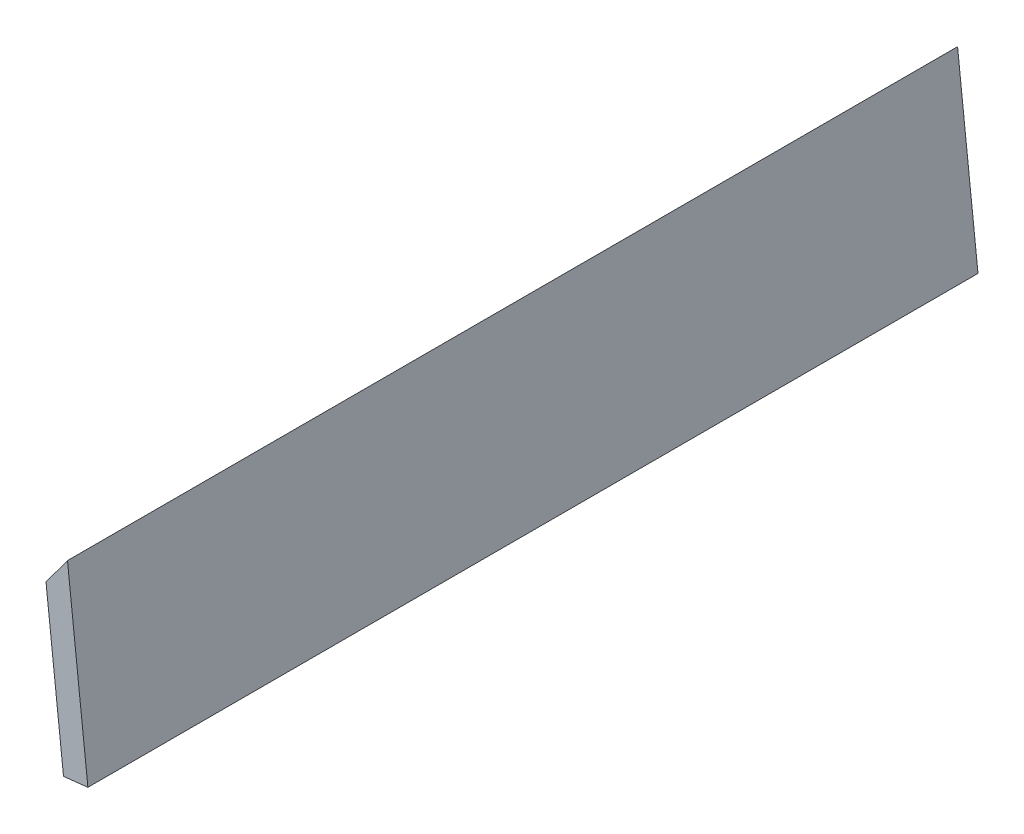
ISO-10303-21;
HEADER;
FILE_DESCRIPTION(('STEP AP214'),'2;1');
FILE_NAME('part.step','',(''),(''),'','','');
FILE_SCHEMA(('AUTOMOTIVE_DESIGN { 1 0 10303 214 1 1 1 1 }'));
ENDSEC;
DATA;
#1=APPLICATION_CONTEXT('core data for automotive mechanical design processes');
#2=APPLICATION_PROTOCOL_DEFINITION('international standard','automotive_design',2000,#1);
#3=PRODUCT_CONTEXT('',#1,'mechanical');
#4=PRODUCT('Part','Part','',(#3));
#5=PRODUCT_RELATED_PRODUCT_CATEGORY('part','',(#4));
#6=PRODUCT_DEFINITION_FORMATION('','',#4);
#7=PRODUCT_DEFINITION_CONTEXT('part definition',#1,'design');
#8=PRODUCT_DEFINITION('design','',#6,#7);
#9=PRODUCT_DEFINITION_SHAPE('','',#8);
#10=(LENGTH_UNIT() NAMED_UNIT(*) SI_UNIT(.MILLI.,.METRE.));
#11=(NAMED_UNIT(*) PLANE_ANGLE_UNIT() SI_UNIT($,.RADIAN.));
#12=(NAMED_UNIT(*) SI_UNIT($,.STERADIAN.) SOLID_ANGLE_UNIT());
#13=UNCERTAINTY_MEASURE_WITH_UNIT(LENGTH_MEASURE(1.E-05),#10,'distance_accuracy_value','');
#14=(GEOMETRIC_REPRESENTATION_CONTEXT(3) GLOBAL_UNCERTAINTY_ASSIGNED_CONTEXT((#13)) GLOBAL_UNIT_ASSIGNED_CONTEXT((#10,
#11,#12)) REPRESENTATION_CONTEXT('',''));
#15=CARTESIAN_POINT('',(0.,0.,0.));
#16=DIRECTION('',(0.,0.,1.));
#17=DIRECTION('',(1.,0.,0.));
#18=AXIS2_PLACEMENT_3D('',#15,#16,#17);
#19=CARTESIAN_POINT('',(-17.2005647618663,-8.95154900167658,127.489407227454));
#20=DIRECTION('',(0.994037808906367,0.109035931988628,0.));
#21=DIRECTION('',(-0.109035931988628,0.994037808906367,0.));
#22=AXIS2_PLACEMENT_3D('',#19,#20,#21);
#23=PLANE('',#22);
#24=DIRECTION('',(0.109035931988628,-0.994037808906367,0.));
#25=VECTOR('',#24,1.);
#26=CARTESIAN_POINT('',(-17.2005647618662,-8.95154900167662,99.8));
#27=LINE('',#26,#25);
#28=CARTESIAN_POINT('',(-17.2005647618663,-8.95154900167658,99.8));
#29=VERTEX_POINT('',#28);
#30=CARTESIAN_POINT('',(-15.237917986071,-26.8442295619912,99.8000000000001));
#31=VERTEX_POINT('',#30);
#32=EDGE_CURVE('E84',#29,#31,#27,.T.);
#33=ORIENTED_EDGE('',*,*,#32,.F.);
#34=DIRECTION('',(0.,0.,-1.));
#35=VECTOR('',#34,1.);
#36=CARTESIAN_POINT('',(-17.2005647618663,-8.95154900167658,127.489407227454));
#37=LINE('',#36,#35);
#38=CARTESIAN_POINT('',(-17.2005647618663,-8.95154900167658,0.));
#39=VERTEX_POINT('',#38);
#40=EDGE_CURVE('E38',#29,#39,#37,.T.);
#41=ORIENTED_EDGE('',*,*,#40,.T.);
#42=DIRECTION('',(0.109035931988628,-0.994037808906367,0.));
#43=VECTOR('',#42,1.);
#44=CARTESIAN_POINT('',(-17.2005647618663,-8.95154900167658,0.));
#45=LINE('',#44,#43);
#46=CARTESIAN_POINT('',(-15.237917986071,-26.8442295619912,0.));
#47=VERTEX_POINT('',#46);
#48=EDGE_CURVE('E82',#39,#47,#45,.T.);
#49=ORIENTED_EDGE('',*,*,#48,.T.);
#50=DIRECTION('',(0.,0.,-1.));
#51=VECTOR('',#50,1.);
#52=CARTESIAN_POINT('',(-15.237917986071,-26.8442295619912,127.489407227454));
#53=LINE('',#52,#51);
#54=EDGE_CURVE('E73',#31,#47,#53,.T.);
#55=ORIENTED_EDGE('',*,*,#54,.F.);
#56=EDGE_LOOP('',(#33,#41,#49,#55));
#57=FACE_BOUND('',#56,.T.);
#58=ADVANCED_FACE('F34',(#57),#23,.F.);
#59=CARTESIAN_POINT('',(-15.237917986071,-26.8442295619912,127.489407227454));
#60=DIRECTION('',(-0.109035931988629,0.994037808906367,0.));
#61=DIRECTION('',(-0.994037808906367,-0.109035931988629,0.));
#62=AXIS2_PLACEMENT_3D('',#59,#60,#61);
#63=PLANE('',#62);
#64=DIRECTION('',(0.994037808906367,0.109035931988629,0.));
#65=VECTOR('',#64,1.);
#66=CARTESIAN_POINT('',(-15.237917986071,-26.8442295619912,99.8000000000001));
#67=LINE('',#66,#65);
#68=CARTESIAN_POINT('',(-12.5035933472544,-26.5443016994073,99.8000000000001));
#69=VERTEX_POINT('',#68);
#70=EDGE_CURVE('E43',#31,#69,#67,.T.);
#71=ORIENTED_EDGE('',*,*,#70,.F.);
#72=ORIENTED_EDGE('',*,*,#54,.T.);
#73=DIRECTION('',(0.994037808906367,0.109035931988629,0.));
#74=VECTOR('',#73,1.);
#75=CARTESIAN_POINT('',(-15.237917986071,-26.8442295619912,0.));
#76=LINE('',#75,#74);
#77=CARTESIAN_POINT('',(-12.5035933472544,-26.5443016994073,0.));
#78=VERTEX_POINT('',#77);
#79=EDGE_CURVE('E94',#47,#78,#76,.T.);
#80=ORIENTED_EDGE('',*,*,#79,.T.);
#81=DIRECTION('',(0.,0.,-1.));
#82=VECTOR('',#81,1.);
#83=CARTESIAN_POINT('',(-12.5035933472544,-26.5443016994073,127.489407227454));
#84=LINE('',#83,#82);
#85=EDGE_CURVE('E103',#69,#78,#84,.T.);
#86=ORIENTED_EDGE('',*,*,#85,.F.);
#87=EDGE_LOOP('',(#71,#72,#80,#86));
#88=FACE_BOUND('',#87,.T.);
#89=ADVANCED_FACE('F107',(#88),#63,.F.);
#90=CARTESIAN_POINT('',(-14.7933479190155,-5.66950771237361,127.489407227454));
#91=DIRECTION('',(-0.994037808906367,-0.109035931988628,0.));
#92=DIRECTION('',(0.109035931988628,-0.994037808906367,0.));
#93=AXIS2_PLACEMENT_3D('',#90,#91,#92);
#94=PLANE('',#93);
#95=DIRECTION('',(-0.109035931988628,0.994037808906367,0.));
#96=VECTOR('',#95,1.);
#97=CARTESIAN_POINT('',(-14.7933479190155,-5.66950771237365,99.8));
#98=LINE('',#97,#96);
#99=CARTESIAN_POINT('',(-14.7933479190155,-5.66950771237361,99.8));
#100=VERTEX_POINT('',#99);
#101=EDGE_CURVE('E12',#69,#100,#98,.T.);
#102=ORIENTED_EDGE('',*,*,#101,.F.);
#103=ORIENTED_EDGE('',*,*,#85,.T.);
#104=DIRECTION('',(-0.109035931988628,0.994037808906367,0.));
#105=VECTOR('',#104,1.);
#106=CARTESIAN_POINT('',(-14.7933479190155,-5.66950771237361,0.));
#107=LINE('',#106,#105);
#108=CARTESIAN_POINT('',(-14.7933479190155,-5.66950771237361,0.));
#109=VERTEX_POINT('',#108);
#110=EDGE_CURVE('E104',#78,#109,#107,.T.);
#111=ORIENTED_EDGE('',*,*,#110,.T.);
#112=DIRECTION('',(0.,0.,-1.));
#113=VECTOR('',#112,1.);
#114=CARTESIAN_POINT('',(-14.7933479190155,-5.66950771237361,127.489407227454));
#115=LINE('',#114,#113);
#116=EDGE_CURVE('E56',#100,#109,#115,.T.);
#117=ORIENTED_EDGE('',*,*,#116,.F.);
#118=EDGE_LOOP('',(#102,#103,#111,#117));
#119=FACE_BOUND('',#118,.T.);
#120=ADVANCED_FACE('F106',(#119),#94,.F.);
#121=CARTESIAN_POINT('',(-17.2005647618663,-8.95154900167658,127.489407227454));
#122=DIRECTION('',(0.806359702266458,-0.591425422653396,0.));
#123=DIRECTION('',(0.591425422653396,0.806359702266458,0.));
#124=AXIS2_PLACEMENT_3D('',#121,#122,#123);
#125=PLANE('',#124);
#126=DIRECTION('',(-0.591425422653396,-0.806359702266458,0.));
#127=VECTOR('',#126,1.);
#128=CARTESIAN_POINT('',(-17.2005647618663,-8.95154900167661,99.8));
#129=LINE('',#128,#127);
#130=EDGE_CURVE('E91',#100,#29,#129,.T.);
#131=ORIENTED_EDGE('',*,*,#130,.F.);
#132=ORIENTED_EDGE('',*,*,#116,.T.);
#133=DIRECTION('',(-0.591425422653396,-0.806359702266458,0.));
#134=VECTOR('',#133,1.);
#135=CARTESIAN_POINT('',(-17.2005647618663,-8.95154900167658,0.));
#136=LINE('',#135,#134);
#137=EDGE_CURVE('E86',#109,#39,#136,.T.);
#138=ORIENTED_EDGE('',*,*,#137,.T.);
#139=ORIENTED_EDGE('',*,*,#40,.F.);
#140=EDGE_LOOP('',(#131,#132,#138,#139));
#141=FACE_BOUND('',#140,.T.);
#142=ADVANCED_FACE('F87',(#141),#125,.F.);
#143=CARTESIAN_POINT('',(0.,0.,0.));
#144=DIRECTION('',(0.,0.,1.));
#145=DIRECTION('',(1.,0.,0.));
#146=AXIS2_PLACEMENT_3D('',#143,#144,#145);
#147=PLANE('',#146);
#148=ORIENTED_EDGE('',*,*,#48,.F.);
#149=ORIENTED_EDGE('',*,*,#137,.F.);
#150=ORIENTED_EDGE('',*,*,#110,.F.);
#151=ORIENTED_EDGE('',*,*,#79,.F.);
#152=EDGE_LOOP('',(#148,#149,#150,#151));
#153=FACE_BOUND('',#152,.T.);
#154=ADVANCED_FACE('F93',(#153),#147,.F.);
#155=CARTESIAN_POINT('',(0.,0.,99.8));
#156=DIRECTION('',(0.,0.,1.));
#157=DIRECTION('',(1.,0.,0.));
#158=AXIS2_PLACEMENT_3D('',#155,#156,#157);
#159=PLANE('',#158);
#160=ORIENTED_EDGE('',*,*,#130,.T.);
#161=ORIENTED_EDGE('',*,*,#32,.T.);
#162=ORIENTED_EDGE('',*,*,#70,.T.);
#163=ORIENTED_EDGE('',*,*,#101,.T.);
#164=EDGE_LOOP('',(#160,#161,#162,#163));
#165=FACE_BOUND('',#164,.T.);
#166=ADVANCED_FACE('F36',(#165),#159,.T.);
#167=CLOSED_SHELL('',(#58,#89,#120,#142,#154,#166));
#168=MANIFOLD_SOLID_BREP('B2',#167);
#169=ADVANCED_BREP_SHAPE_REPRESENTATION('',(#18,#168),#14);
#170=SHAPE_DEFINITION_REPRESENTATION(#9,#169);
ENDSEC;
END-ISO-10303-21;
